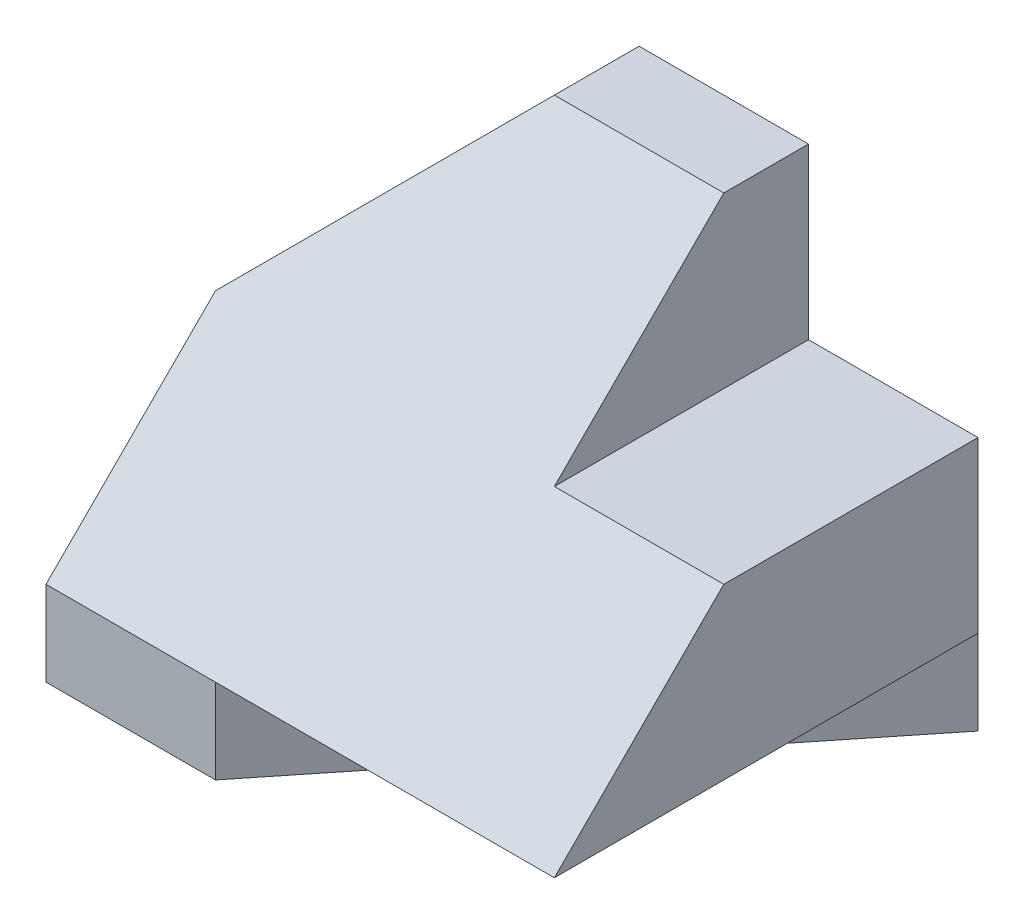
ISO-10303-21;
HEADER;
FILE_DESCRIPTION(('STEP AP214'),'2;1');
FILE_NAME('part.step','',(''),(''),'','','');
FILE_SCHEMA(('AUTOMOTIVE_DESIGN { 1 0 10303 214 1 1 1 1 }'));
ENDSEC;
DATA;
#1=APPLICATION_CONTEXT('core data for automotive mechanical design processes');
#2=APPLICATION_PROTOCOL_DEFINITION('international standard','automotive_design',2000,#1);
#3=PRODUCT_CONTEXT('',#1,'mechanical');
#4=PRODUCT('Part','Part','',(#3));
#5=PRODUCT_RELATED_PRODUCT_CATEGORY('part','',(#4));
#6=PRODUCT_DEFINITION_FORMATION('','',#4);
#7=PRODUCT_DEFINITION_CONTEXT('part definition',#1,'design');
#8=PRODUCT_DEFINITION('design','',#6,#7);
#9=PRODUCT_DEFINITION_SHAPE('','',#8);
#10=(LENGTH_UNIT() NAMED_UNIT(*) SI_UNIT(.MILLI.,.METRE.));
#11=(NAMED_UNIT(*) PLANE_ANGLE_UNIT() SI_UNIT($,.RADIAN.));
#12=(NAMED_UNIT(*) SI_UNIT($,.STERADIAN.) SOLID_ANGLE_UNIT());
#13=UNCERTAINTY_MEASURE_WITH_UNIT(LENGTH_MEASURE(1.E-05),#10,'distance_accuracy_value','');
#14=(GEOMETRIC_REPRESENTATION_CONTEXT(3) GLOBAL_UNCERTAINTY_ASSIGNED_CONTEXT((#13)) GLOBAL_UNIT_ASSIGNED_CONTEXT((#10,
#11,#12)) REPRESENTATION_CONTEXT('',''));
#15=CARTESIAN_POINT('',(0.,0.,0.));
#16=DIRECTION('',(0.,0.,1.));
#17=DIRECTION('',(1.,0.,0.));
#18=AXIS2_PLACEMENT_3D('',#15,#16,#17);
#19=CARTESIAN_POINT('',(0.,0.,25.));
#20=DIRECTION('',(1.,0.,0.));
#21=DIRECTION('',(0.,0.,-1.));
#22=AXIS2_PLACEMENT_3D('',#19,#20,#21);
#23=PLANE('',#22);
#24=DIRECTION('',(0.,-0.707106781186548,0.707106781186548));
#25=VECTOR('',#24,1.);
#26=CARTESIAN_POINT('',(0.,5.,25.));
#27=LINE('',#26,#25);
#28=CARTESIAN_POINT('',(0.,15.,15.));
#29=VERTEX_POINT('',#28);
#30=CARTESIAN_POINT('',(0.,5.,25.));
#31=VERTEX_POINT('',#30);
#32=EDGE_CURVE('E176',#29,#31,#27,.T.);
#33=ORIENTED_EDGE('',*,*,#32,.F.);
#34=DIRECTION('',(0.,0.,-1.));
#35=VECTOR('',#34,1.);
#36=CARTESIAN_POINT('',(0.,15.,20.));
#37=LINE('',#36,#35);
#38=CARTESIAN_POINT('',(0.,15.,5.));
#39=VERTEX_POINT('',#38);
#40=EDGE_CURVE('E225',#29,#39,#37,.T.);
#41=ORIENTED_EDGE('',*,*,#40,.T.);
#42=DIRECTION('',(0.,1.,0.));
#43=VECTOR('',#42,1.);
#44=CARTESIAN_POINT('',(0.,0.,5.));
#45=LINE('',#44,#43);
#46=CARTESIAN_POINT('',(0.,5.,5.));
#47=VERTEX_POINT('',#46);
#48=EDGE_CURVE('E191',#47,#39,#45,.T.);
#49=ORIENTED_EDGE('',*,*,#48,.F.);
#50=DIRECTION('',(0.,0.,-1.));
#51=VECTOR('',#50,1.);
#52=CARTESIAN_POINT('',(0.,5.,25.));
#53=LINE('',#52,#51);
#54=EDGE_CURVE('E208',#31,#47,#53,.T.);
#55=ORIENTED_EDGE('',*,*,#54,.F.);
#56=EDGE_LOOP('',(#33,#41,#49,#55));
#57=FACE_BOUND('',#56,.T.);
#58=ADVANCED_FACE('F33',(#57),#23,.F.);
#59=CARTESIAN_POINT('',(0.,0.,25.));
#60=DIRECTION('',(0.,1.,0.));
#61=DIRECTION('',(0.,0.,1.));
#62=AXIS2_PLACEMENT_3D('',#59,#60,#61);
#63=PLANE('',#62);
#64=DIRECTION('',(1.,0.,0.));
#65=VECTOR('',#64,1.);
#66=CARTESIAN_POINT('',(0.,0.,0.));
#67=LINE('',#66,#65);
#68=CARTESIAN_POINT('',(10.,0.,0.));
#69=VERTEX_POINT('',#68);
#70=CARTESIAN_POINT('',(30.,0.,0.));
#71=VERTEX_POINT('',#70);
#72=EDGE_CURVE('E156',#69,#71,#67,.T.);
#73=ORIENTED_EDGE('',*,*,#72,.T.);
#74=DIRECTION('',(0.624695047554424,0.,-0.78086880944303));
#75=VECTOR('',#74,1.);
#76=CARTESIAN_POINT('',(10.,0.,25.));
#77=LINE('',#76,#75);
#78=CARTESIAN_POINT('',(10.,0.,25.));
#79=VERTEX_POINT('',#78);
#80=EDGE_CURVE('E126',#79,#71,#77,.T.);
#81=ORIENTED_EDGE('',*,*,#80,.F.);
#82=DIRECTION('',(1.,0.,0.));
#83=VECTOR('',#82,1.);
#84=CARTESIAN_POINT('',(0.,0.,25.));
#85=LINE('',#84,#83);
#86=CARTESIAN_POINT('',(0.,0.,25.));
#87=VERTEX_POINT('',#86);
#88=EDGE_CURVE('E40',#87,#79,#85,.T.);
#89=ORIENTED_EDGE('',*,*,#88,.F.);
#90=DIRECTION('',(-0.447213595499958,0.,0.894427190999916));
#91=VECTOR('',#90,1.);
#92=CARTESIAN_POINT('',(10.,0.,5.));
#93=LINE('',#92,#91);
#94=CARTESIAN_POINT('',(10.,0.,5.));
#95=VERTEX_POINT('',#94);
#96=EDGE_CURVE('E203',#95,#87,#93,.T.);
#97=ORIENTED_EDGE('',*,*,#96,.F.);
#98=DIRECTION('',(0.,0.,1.));
#99=VECTOR('',#98,1.);
#100=CARTESIAN_POINT('',(10.,0.,0.));
#101=LINE('',#100,#99);
#102=EDGE_CURVE('E199',#69,#95,#101,.T.);
#103=ORIENTED_EDGE('',*,*,#102,.F.);
#104=EDGE_LOOP('',(#73,#81,#89,#97,#103));
#105=FACE_BOUND('',#104,.T.);
#106=ADVANCED_FACE('F235',(#105),#63,.F.);
#107=CARTESIAN_POINT('',(30.,0.,25.));
#108=DIRECTION('',(-1.,0.,0.));
#109=DIRECTION('',(0.,0.,1.));
#110=AXIS2_PLACEMENT_3D('',#107,#108,#109);
#111=PLANE('',#110);
#112=DIRECTION('',(0.,-0.707106781186548,0.707106781186548));
#113=VECTOR('',#112,1.);
#114=CARTESIAN_POINT('',(30.,5.,25.));
#115=LINE('',#114,#113);
#116=CARTESIAN_POINT('',(30.,15.,15.));
#117=VERTEX_POINT('',#116);
#118=CARTESIAN_POINT('',(30.,5.,25.));
#119=VERTEX_POINT('',#118);
#120=EDGE_CURVE('E147',#117,#119,#115,.T.);
#121=ORIENTED_EDGE('',*,*,#120,.T.);
#122=DIRECTION('',(0.,0.,1.));
#123=VECTOR('',#122,1.);
#124=CARTESIAN_POINT('',(30.,5.,0.));
#125=LINE('',#124,#123);
#126=CARTESIAN_POINT('',(30.,5.,0.));
#127=VERTEX_POINT('',#126);
#128=EDGE_CURVE('E137',#127,#119,#125,.T.);
#129=ORIENTED_EDGE('',*,*,#128,.F.);
#130=DIRECTION('',(0.,1.,0.));
#131=VECTOR('',#130,1.);
#132=CARTESIAN_POINT('',(30.,0.,0.));
#133=LINE('',#132,#131);
#134=CARTESIAN_POINT('',(30.,15.,0.));
#135=VERTEX_POINT('',#134);
#136=EDGE_CURVE('E132',#127,#135,#133,.T.);
#137=ORIENTED_EDGE('',*,*,#136,.T.);
#138=DIRECTION('',(0.,0.,-1.));
#139=VECTOR('',#138,1.);
#140=CARTESIAN_POINT('',(30.,15.,0.));
#141=LINE('',#140,#139);
#142=EDGE_CURVE('E214',#117,#135,#141,.T.);
#143=ORIENTED_EDGE('',*,*,#142,.F.);
#144=EDGE_LOOP('',(#121,#129,#137,#143));
#145=FACE_BOUND('',#144,.T.);
#146=ADVANCED_FACE('F144',(#145),#111,.F.);
#147=CARTESIAN_POINT('',(0.,25.,25.));
#148=DIRECTION('',(0.,-1.,0.));
#149=DIRECTION('',(0.,0.,-1.));
#150=AXIS2_PLACEMENT_3D('',#147,#148,#149);
#151=PLANE('',#150);
#152=DIRECTION('',(-1.,0.,0.));
#153=VECTOR('',#152,1.);
#154=CARTESIAN_POINT('',(0.,25.,0.));
#155=LINE('',#154,#153);
#156=CARTESIAN_POINT('',(20.,25.,0.));
#157=VERTEX_POINT('',#156);
#158=CARTESIAN_POINT('',(10.,25.,0.));
#159=VERTEX_POINT('',#158);
#160=EDGE_CURVE('E131',#157,#159,#155,.T.);
#161=ORIENTED_EDGE('',*,*,#160,.T.);
#162=DIRECTION('',(0.,0.,-1.));
#163=VECTOR('',#162,1.);
#164=CARTESIAN_POINT('',(10.,25.,20.));
#165=LINE('',#164,#163);
#166=CARTESIAN_POINT('',(10.,25.,5.));
#167=VERTEX_POINT('',#166);
#168=EDGE_CURVE('E226',#167,#159,#165,.T.);
#169=ORIENTED_EDGE('',*,*,#168,.F.);
#170=DIRECTION('',(-1.,0.,0.));
#171=VECTOR('',#170,1.);
#172=CARTESIAN_POINT('',(30.,25.,5.));
#173=LINE('',#172,#171);
#174=CARTESIAN_POINT('',(20.,25.,5.));
#175=VERTEX_POINT('',#174);
#176=EDGE_CURVE('E171',#175,#167,#173,.T.);
#177=ORIENTED_EDGE('',*,*,#176,.F.);
#178=DIRECTION('',(0.,0.,1.));
#179=VECTOR('',#178,1.);
#180=CARTESIAN_POINT('',(20.,25.,0.));
#181=LINE('',#180,#179);
#182=EDGE_CURVE('E47',#157,#175,#181,.T.);
#183=ORIENTED_EDGE('',*,*,#182,.F.);
#184=EDGE_LOOP('',(#161,#169,#177,#183));
#185=FACE_BOUND('',#184,.T.);
#186=ADVANCED_FACE('F240',(#185),#151,.F.);
#187=CARTESIAN_POINT('',(0.,0.,25.));
#188=DIRECTION('',(0.,0.,-1.));
#189=DIRECTION('',(-1.,0.,0.));
#190=AXIS2_PLACEMENT_3D('',#187,#188,#189);
#191=PLANE('',#190);
#192=ORIENTED_EDGE('',*,*,#88,.T.);
#193=DIRECTION('',(0.,-1.,0.));
#194=VECTOR('',#193,1.);
#195=CARTESIAN_POINT('',(10.,5.,25.));
#196=LINE('',#195,#194);
#197=CARTESIAN_POINT('',(10.,5.,25.));
#198=VERTEX_POINT('',#197);
#199=EDGE_CURVE('E148',#198,#79,#196,.T.);
#200=ORIENTED_EDGE('',*,*,#199,.F.);
#201=DIRECTION('',(-1.,0.,0.));
#202=VECTOR('',#201,1.);
#203=CARTESIAN_POINT('',(30.,5.,25.));
#204=LINE('',#203,#202);
#205=EDGE_CURVE('E174',#198,#31,#204,.T.);
#206=ORIENTED_EDGE('',*,*,#205,.T.);
#207=DIRECTION('',(0.,-1.,0.));
#208=VECTOR('',#207,1.);
#209=CARTESIAN_POINT('',(0.,0.,25.));
#210=LINE('',#209,#208);
#211=EDGE_CURVE('E160',#31,#87,#210,.T.);
#212=ORIENTED_EDGE('',*,*,#211,.T.);
#213=EDGE_LOOP('',(#192,#200,#206,#212));
#214=FACE_BOUND('',#213,.T.);
#215=ADVANCED_FACE('F238',(#214),#191,.F.);
#216=CARTESIAN_POINT('',(0.,0.,0.));
#217=DIRECTION('',(0.,0.,-1.));
#218=DIRECTION('',(-1.,0.,0.));
#219=AXIS2_PLACEMENT_3D('',#216,#217,#218);
#220=PLANE('',#219);
#221=DIRECTION('',(-0.707106781186548,-0.707106781186547,0.));
#222=VECTOR('',#221,1.);
#223=CARTESIAN_POINT('',(10.,25.,0.));
#224=LINE('',#223,#222);
#225=CARTESIAN_POINT('',(0.,15.,0.));
#226=VERTEX_POINT('',#225);
#227=EDGE_CURVE('E228',#159,#226,#224,.T.);
#228=ORIENTED_EDGE('',*,*,#227,.F.);
#229=ORIENTED_EDGE('',*,*,#160,.F.);
#230=DIRECTION('',(0.,1.,0.));
#231=VECTOR('',#230,1.);
#232=CARTESIAN_POINT('',(20.,15.,0.));
#233=LINE('',#232,#231);
#234=CARTESIAN_POINT('',(20.,15.,0.));
#235=VERTEX_POINT('',#234);
#236=EDGE_CURVE('E206',#235,#157,#233,.T.);
#237=ORIENTED_EDGE('',*,*,#236,.F.);
#238=DIRECTION('',(-1.,0.,0.));
#239=VECTOR('',#238,1.);
#240=CARTESIAN_POINT('',(30.,15.,0.));
#241=LINE('',#240,#239);
#242=EDGE_CURVE('E155',#135,#235,#241,.T.);
#243=ORIENTED_EDGE('',*,*,#242,.F.);
#244=ORIENTED_EDGE('',*,*,#136,.F.);
#245=EDGE_CURVE('E120',#71,#127,#133,.T.);
#246=ORIENTED_EDGE('',*,*,#245,.F.);
#247=ORIENTED_EDGE('',*,*,#72,.F.);
#248=DIRECTION('',(0.,-1.,0.));
#249=VECTOR('',#248,1.);
#250=CARTESIAN_POINT('',(10.,0.,0.));
#251=LINE('',#250,#249);
#252=CARTESIAN_POINT('',(10.,15.,0.));
#253=VERTEX_POINT('',#252);
#254=EDGE_CURVE('E190',#253,#69,#251,.T.);
#255=ORIENTED_EDGE('',*,*,#254,.F.);
#256=DIRECTION('',(-1.,0.,0.));
#257=VECTOR('',#256,1.);
#258=CARTESIAN_POINT('',(10.,15.,0.));
#259=LINE('',#258,#257);
#260=EDGE_CURVE('E179',#253,#226,#259,.T.);
#261=ORIENTED_EDGE('',*,*,#260,.T.);
#262=EDGE_LOOP('',(#228,#229,#237,#243,#244,#246,#247,#255,#261));
#263=FACE_BOUND('',#262,.T.);
#264=ADVANCED_FACE('F152',(#263),#220,.T.);
#265=CARTESIAN_POINT('',(30.,5.,25.));
#266=DIRECTION('',(0.,-0.707106781186547,-0.707106781186547));
#267=DIRECTION('',(0.,0.707106781186548,-0.707106781186548));
#268=AXIS2_PLACEMENT_3D('',#265,#266,#267);
#269=PLANE('',#268);
#270=ORIENTED_EDGE('',*,*,#176,.T.);
#271=DIRECTION('',(-0.577350269189626,-0.577350269189626,0.577350269189626));
#272=VECTOR('',#271,1.);
#273=CARTESIAN_POINT('',(3.33333333333334,18.3333333333333,11.6666666666667));
#274=LINE('',#273,#272);
#275=EDGE_CURVE('E222',#167,#29,#274,.T.);
#276=ORIENTED_EDGE('',*,*,#275,.T.);
#277=ORIENTED_EDGE('',*,*,#32,.T.);
#278=ORIENTED_EDGE('',*,*,#205,.F.);
#279=EDGE_CURVE('E140',#119,#198,#204,.T.);
#280=ORIENTED_EDGE('',*,*,#279,.F.);
#281=ORIENTED_EDGE('',*,*,#120,.F.);
#282=DIRECTION('',(1.,0.,0.));
#283=VECTOR('',#282,1.);
#284=CARTESIAN_POINT('',(20.,15.,15.));
#285=LINE('',#284,#283);
#286=CARTESIAN_POINT('',(20.,15.,15.));
#287=VERTEX_POINT('',#286);
#288=EDGE_CURVE('E215',#287,#117,#285,.T.);
#289=ORIENTED_EDGE('',*,*,#288,.F.);
#290=DIRECTION('',(0.,0.707106781186548,-0.707106781186548));
#291=VECTOR('',#290,1.);
#292=CARTESIAN_POINT('',(20.,5.,25.));
#293=LINE('',#292,#291);
#294=EDGE_CURVE('E11',#287,#175,#293,.T.);
#295=ORIENTED_EDGE('',*,*,#294,.T.);
#296=EDGE_LOOP('',(#270,#276,#277,#278,#280,#281,#289,#295));
#297=FACE_BOUND('',#296,.T.);
#298=ADVANCED_FACE('F246',(#297),#269,.F.);
#299=CARTESIAN_POINT('',(10.,15.,0.));
#300=DIRECTION('',(0.,1.,0.));
#301=DIRECTION('',(0.,0.,1.));
#302=AXIS2_PLACEMENT_3D('',#299,#300,#301);
#303=PLANE('',#302);
#304=DIRECTION('',(0.,0.,-1.));
#305=VECTOR('',#304,1.);
#306=CARTESIAN_POINT('',(0.,15.,0.));
#307=LINE('',#306,#305);
#308=EDGE_CURVE('E187',#39,#226,#307,.T.);
#309=ORIENTED_EDGE('',*,*,#308,.T.);
#310=ORIENTED_EDGE('',*,*,#260,.F.);
#311=DIRECTION('',(0.,0.,-1.));
#312=VECTOR('',#311,1.);
#313=CARTESIAN_POINT('',(10.,15.,0.));
#314=LINE('',#313,#312);
#315=CARTESIAN_POINT('',(10.,15.,5.));
#316=VERTEX_POINT('',#315);
#317=EDGE_CURVE('E184',#316,#253,#314,.T.);
#318=ORIENTED_EDGE('',*,*,#317,.F.);
#319=DIRECTION('',(-1.,0.,0.));
#320=VECTOR('',#319,1.);
#321=CARTESIAN_POINT('',(10.,15.,5.));
#322=LINE('',#321,#320);
#323=EDGE_CURVE('E181',#316,#39,#322,.T.);
#324=ORIENTED_EDGE('',*,*,#323,.T.);
#325=EDGE_LOOP('',(#309,#310,#318,#324));
#326=FACE_BOUND('',#325,.T.);
#327=ADVANCED_FACE('F272',(#326),#303,.F.);
#328=CARTESIAN_POINT('',(10.,0.,5.));
#329=DIRECTION('',(0.,0.,1.));
#330=DIRECTION('',(1.,0.,0.));
#331=AXIS2_PLACEMENT_3D('',#328,#329,#330);
#332=PLANE('',#331);
#333=DIRECTION('',(0.,1.,0.));
#334=VECTOR('',#333,1.);
#335=CARTESIAN_POINT('',(10.,0.,5.));
#336=LINE('',#335,#334);
#337=CARTESIAN_POINT('',(10.,5.,5.));
#338=VERTEX_POINT('',#337);
#339=EDGE_CURVE('E198',#338,#316,#336,.T.);
#340=ORIENTED_EDGE('',*,*,#339,.F.);
#341=DIRECTION('',(1.,0.,0.));
#342=VECTOR('',#341,1.);
#343=CARTESIAN_POINT('',(0.,5.,5.));
#344=LINE('',#343,#342);
#345=EDGE_CURVE('E54',#47,#338,#344,.T.);
#346=ORIENTED_EDGE('',*,*,#345,.F.);
#347=ORIENTED_EDGE('',*,*,#48,.T.);
#348=ORIENTED_EDGE('',*,*,#323,.F.);
#349=EDGE_LOOP('',(#340,#346,#347,#348));
#350=FACE_BOUND('',#349,.T.);
#351=ADVANCED_FACE('F264',(#350),#332,.F.);
#352=CARTESIAN_POINT('',(10.,0.,0.));
#353=DIRECTION('',(1.,0.,0.));
#354=DIRECTION('',(0.,0.,-1.));
#355=AXIS2_PLACEMENT_3D('',#352,#353,#354);
#356=PLANE('',#355);
#357=ORIENTED_EDGE('',*,*,#254,.T.);
#358=ORIENTED_EDGE('',*,*,#102,.T.);
#359=EDGE_CURVE('E195',#95,#338,#336,.T.);
#360=ORIENTED_EDGE('',*,*,#359,.T.);
#361=ORIENTED_EDGE('',*,*,#339,.T.);
#362=ORIENTED_EDGE('',*,*,#317,.T.);
#363=EDGE_LOOP('',(#357,#358,#360,#361,#362));
#364=FACE_BOUND('',#363,.T.);
#365=ADVANCED_FACE('F268',(#364),#356,.F.);
#366=CARTESIAN_POINT('',(10.,5.,5.));
#367=DIRECTION('',(0.894427190999916,0.,0.447213595499958));
#368=DIRECTION('',(0.447213595499958,0.,-0.894427190999916));
#369=AXIS2_PLACEMENT_3D('',#366,#367,#368);
#370=PLANE('',#369);
#371=ORIENTED_EDGE('',*,*,#96,.T.);
#372=ORIENTED_EDGE('',*,*,#211,.F.);
#373=DIRECTION('',(-0.447213595499958,0.,0.894427190999916));
#374=VECTOR('',#373,1.);
#375=CARTESIAN_POINT('',(10.,5.,5.));
#376=LINE('',#375,#374);
#377=EDGE_CURVE('E205',#338,#31,#376,.T.);
#378=ORIENTED_EDGE('',*,*,#377,.F.);
#379=ORIENTED_EDGE('',*,*,#359,.F.);
#380=EDGE_LOOP('',(#371,#372,#378,#379));
#381=FACE_BOUND('',#380,.T.);
#382=ADVANCED_FACE('F260',(#381),#370,.F.);
#383=CARTESIAN_POINT('',(0.,5.,0.));
#384=DIRECTION('',(0.,1.,0.));
#385=DIRECTION('',(0.,0.,1.));
#386=AXIS2_PLACEMENT_3D('',#383,#384,#385);
#387=PLANE('',#386);
#388=ORIENTED_EDGE('',*,*,#377,.T.);
#389=ORIENTED_EDGE('',*,*,#54,.T.);
#390=ORIENTED_EDGE('',*,*,#345,.T.);
#391=EDGE_LOOP('',(#388,#389,#390));
#392=FACE_BOUND('',#391,.T.);
#393=ADVANCED_FACE('F262',(#392),#387,.F.);
#394=CARTESIAN_POINT('',(20.,15.,0.));
#395=DIRECTION('',(-1.,0.,0.));
#396=DIRECTION('',(0.,0.,1.));
#397=AXIS2_PLACEMENT_3D('',#394,#395,#396);
#398=PLANE('',#397);
#399=ORIENTED_EDGE('',*,*,#294,.F.);
#400=DIRECTION('',(0.,0.,1.));
#401=VECTOR('',#400,1.);
#402=CARTESIAN_POINT('',(20.,15.,0.));
#403=LINE('',#402,#401);
#404=EDGE_CURVE('E212',#235,#287,#403,.T.);
#405=ORIENTED_EDGE('',*,*,#404,.F.);
#406=ORIENTED_EDGE('',*,*,#236,.T.);
#407=ORIENTED_EDGE('',*,*,#182,.T.);
#408=EDGE_LOOP('',(#399,#405,#406,#407));
#409=FACE_BOUND('',#408,.T.);
#410=ADVANCED_FACE('F275',(#409),#398,.F.);
#411=CARTESIAN_POINT('',(0.,15.,0.));
#412=DIRECTION('',(0.,-1.,0.));
#413=DIRECTION('',(0.,0.,-1.));
#414=AXIS2_PLACEMENT_3D('',#411,#412,#413);
#415=PLANE('',#414);
#416=ORIENTED_EDGE('',*,*,#142,.T.);
#417=ORIENTED_EDGE('',*,*,#242,.T.);
#418=ORIENTED_EDGE('',*,*,#404,.T.);
#419=ORIENTED_EDGE('',*,*,#288,.T.);
#420=EDGE_LOOP('',(#416,#417,#418,#419));
#421=FACE_BOUND('',#420,.T.);
#422=ADVANCED_FACE('F279',(#421),#415,.F.);
#423=CARTESIAN_POINT('',(10.,25.,20.));
#424=DIRECTION('',(0.707106781186547,-0.707106781186548,0.));
#425=DIRECTION('',(0.707106781186548,0.707106781186547,0.));
#426=AXIS2_PLACEMENT_3D('',#423,#424,#425);
#427=PLANE('',#426);
#428=ORIENTED_EDGE('',*,*,#168,.T.);
#429=ORIENTED_EDGE('',*,*,#227,.T.);
#430=ORIENTED_EDGE('',*,*,#308,.F.);
#431=ORIENTED_EDGE('',*,*,#40,.F.);
#432=ORIENTED_EDGE('',*,*,#275,.F.);
#433=EDGE_LOOP('',(#428,#429,#430,#431,#432));
#434=FACE_BOUND('',#433,.T.);
#435=ADVANCED_FACE('F274',(#434),#427,.F.);
#436=CARTESIAN_POINT('',(10.,5.,25.));
#437=DIRECTION('',(-0.78086880944303,0.,-0.624695047554424));
#438=DIRECTION('',(-0.624695047554424,0.,0.78086880944303));
#439=AXIS2_PLACEMENT_3D('',#436,#437,#438);
#440=PLANE('',#439);
#441=ORIENTED_EDGE('',*,*,#80,.T.);
#442=ORIENTED_EDGE('',*,*,#245,.T.);
#443=DIRECTION('',(0.624695047554424,0.,-0.78086880944303));
#444=VECTOR('',#443,1.);
#445=CARTESIAN_POINT('',(10.,5.,25.));
#446=LINE('',#445,#444);
#447=EDGE_CURVE('E123',#198,#127,#446,.T.);
#448=ORIENTED_EDGE('',*,*,#447,.F.);
#449=ORIENTED_EDGE('',*,*,#199,.T.);
#450=EDGE_LOOP('',(#441,#442,#448,#449));
#451=FACE_BOUND('',#450,.T.);
#452=ADVANCED_FACE('F122',(#451),#440,.F.);
#453=CARTESIAN_POINT('',(0.,5.,0.));
#454=DIRECTION('',(0.,1.,0.));
#455=DIRECTION('',(0.,0.,1.));
#456=AXIS2_PLACEMENT_3D('',#453,#454,#455);
#457=PLANE('',#456);
#458=ORIENTED_EDGE('',*,*,#447,.T.);
#459=ORIENTED_EDGE('',*,*,#128,.T.);
#460=ORIENTED_EDGE('',*,*,#279,.T.);
#461=EDGE_LOOP('',(#458,#459,#460));
#462=FACE_BOUND('',#461,.T.);
#463=ADVANCED_FACE('F136',(#462),#457,.F.);
#464=CLOSED_SHELL('',(#58,#106,#146,#186,#215,#264,#298,#327,#351,#365,#382,#393,#410,#422,#435,
#452,#463));
#465=MANIFOLD_SOLID_BREP('B2',#464);
#466=ADVANCED_BREP_SHAPE_REPRESENTATION('',(#18,#465),#14);
#467=SHAPE_DEFINITION_REPRESENTATION(#9,#466);
ENDSEC;
END-ISO-10303-21;
